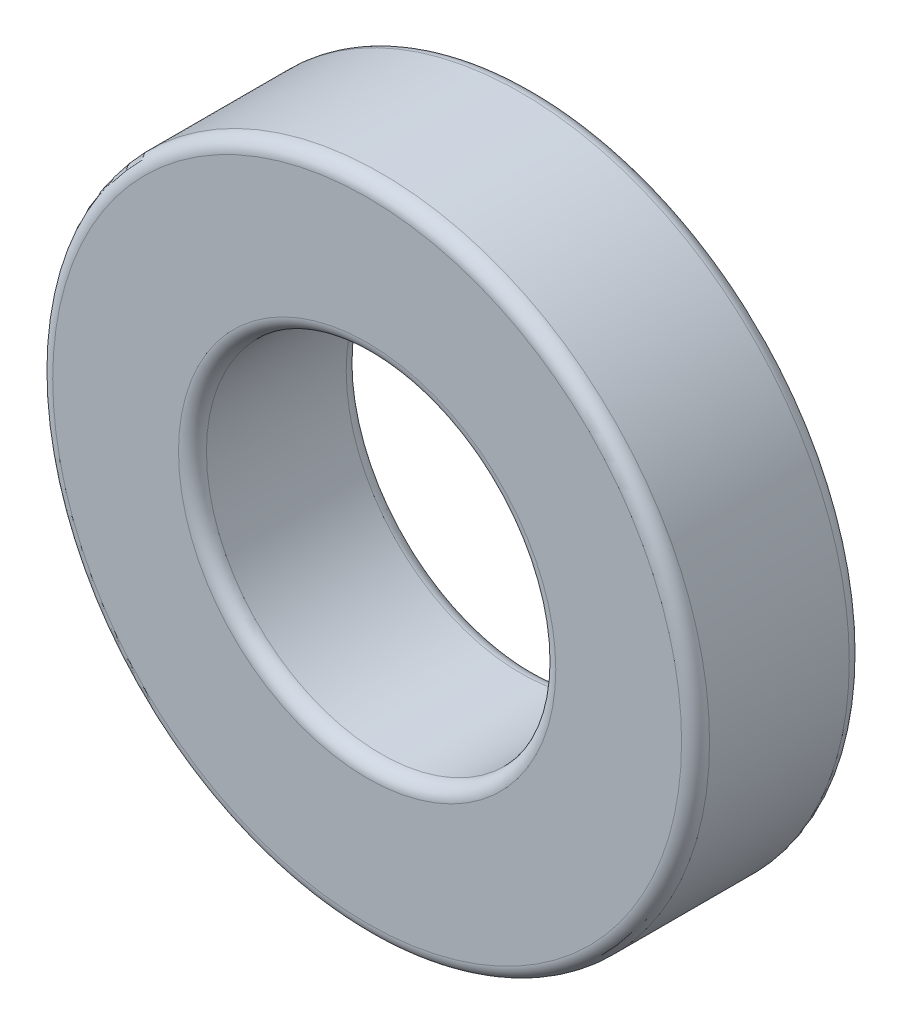
ISO-10303-21;
HEADER;
FILE_DESCRIPTION(('STEP AP214'),'2;1');
FILE_NAME('part.step','',(''),(''),'','','');
FILE_SCHEMA(('AUTOMOTIVE_DESIGN { 1 0 10303 214 1 1 1 1 }'));
ENDSEC;
DATA;
#1=APPLICATION_CONTEXT('core data for automotive mechanical design processes');
#2=APPLICATION_PROTOCOL_DEFINITION('international standard','automotive_design',2000,#1);
#3=PRODUCT_CONTEXT('',#1,'mechanical');
#4=PRODUCT('Part','Part','',(#3));
#5=PRODUCT_RELATED_PRODUCT_CATEGORY('part','',(#4));
#6=PRODUCT_DEFINITION_FORMATION('','',#4);
#7=PRODUCT_DEFINITION_CONTEXT('part definition',#1,'design');
#8=PRODUCT_DEFINITION('design','',#6,#7);
#9=PRODUCT_DEFINITION_SHAPE('','',#8);
#10=(LENGTH_UNIT() NAMED_UNIT(*) SI_UNIT(.MILLI.,.METRE.));
#11=(NAMED_UNIT(*) PLANE_ANGLE_UNIT() SI_UNIT($,.RADIAN.));
#12=(NAMED_UNIT(*) SI_UNIT($,.STERADIAN.) SOLID_ANGLE_UNIT());
#13=UNCERTAINTY_MEASURE_WITH_UNIT(LENGTH_MEASURE(1.E-05),#10,'distance_accuracy_value','');
#14=(GEOMETRIC_REPRESENTATION_CONTEXT(3) GLOBAL_UNCERTAINTY_ASSIGNED_CONTEXT((#13)) GLOBAL_UNIT_ASSIGNED_CONTEXT((#10,
#11,#12)) REPRESENTATION_CONTEXT('',''));
#15=CARTESIAN_POINT('',(0.,0.,0.));
#16=DIRECTION('',(0.,0.,1.));
#17=DIRECTION('',(1.,0.,0.));
#18=AXIS2_PLACEMENT_3D('',#15,#16,#17);
#19=CARTESIAN_POINT('',(0.,0.,12.));
#20=DIRECTION('',(0.,0.,1.));
#21=DIRECTION('',(1.,0.,0.));
#22=AXIS2_PLACEMENT_3D('',#19,#20,#21);
#23=PLANE('',#22);
#24=CARTESIAN_POINT('',(0.,0.,12.));
#25=DIRECTION('',(0.,0.,1.));
#26=DIRECTION('',(1.,0.,0.));
#27=AXIS2_PLACEMENT_3D('',#24,#25,#26);
#28=CIRCLE('',#27,13.5);
#29=CARTESIAN_POINT('',(13.5,0.,12.));
#30=VERTEX_POINT('',#29);
#31=EDGE_CURVE('E43',#30,#30,#28,.F.);
#32=ORIENTED_EDGE('',*,*,#31,.T.);
#33=EDGE_LOOP('',(#32));
#34=FACE_BOUND('',#33,.T.);
#35=CARTESIAN_POINT('',(0.,0.,12.));
#36=DIRECTION('',(0.,0.,1.));
#37=DIRECTION('',(1.,0.,0.));
#38=AXIS2_PLACEMENT_3D('',#35,#36,#37);
#39=CIRCLE('',#38,22.5);
#40=CARTESIAN_POINT('',(22.5,0.,12.));
#41=VERTEX_POINT('',#40);
#42=EDGE_CURVE('E47',#41,#41,#39,.T.);
#43=ORIENTED_EDGE('',*,*,#42,.T.);
#44=EDGE_LOOP('',(#43));
#45=FACE_BOUND('',#44,.T.);
#46=ADVANCED_FACE('F32',(#34,#45),#23,.T.);
#47=CARTESIAN_POINT('',(0.,0.,0.));
#48=DIRECTION('',(0.,0.,1.));
#49=DIRECTION('',(1.,0.,0.));
#50=AXIS2_PLACEMENT_3D('',#47,#48,#49);
#51=PLANE('',#50);
#52=CARTESIAN_POINT('',(0.,0.,0.));
#53=DIRECTION('',(0.,0.,1.));
#54=DIRECTION('',(1.,0.,0.));
#55=AXIS2_PLACEMENT_3D('',#52,#53,#54);
#56=CIRCLE('',#55,13.5);
#57=CARTESIAN_POINT('',(13.5,0.,0.));
#58=VERTEX_POINT('',#57);
#59=EDGE_CURVE('E58',#58,#58,#56,.T.);
#60=ORIENTED_EDGE('',*,*,#59,.T.);
#61=EDGE_LOOP('',(#60));
#62=FACE_BOUND('',#61,.T.);
#63=CARTESIAN_POINT('',(0.,0.,0.));
#64=DIRECTION('',(0.,0.,1.));
#65=DIRECTION('',(1.,0.,0.));
#66=AXIS2_PLACEMENT_3D('',#63,#64,#65);
#67=CIRCLE('',#66,22.5);
#68=CARTESIAN_POINT('',(22.5,0.,0.));
#69=VERTEX_POINT('',#68);
#70=EDGE_CURVE('E61',#69,#69,#67,.F.);
#71=ORIENTED_EDGE('',*,*,#70,.T.);
#72=EDGE_LOOP('',(#71));
#73=FACE_BOUND('',#72,.T.);
#74=ADVANCED_FACE('F65',(#62,#73),#51,.F.);
#75=CARTESIAN_POINT('',(0.,0.,12.));
#76=DIRECTION('',(0.,0.,-1.));
#77=DIRECTION('',(-1.,0.,0.));
#78=AXIS2_PLACEMENT_3D('',#75,#76,#77);
#79=CYLINDRICAL_SURFACE('',#78,23.5);
#80=CARTESIAN_POINT('',(0.,0.,1.));
#81=DIRECTION('',(0.,0.,1.));
#82=DIRECTION('',(1.,0.,0.));
#83=AXIS2_PLACEMENT_3D('',#80,#81,#82);
#84=CIRCLE('',#83,23.5);
#85=CARTESIAN_POINT('',(23.5,0.,1.));
#86=VERTEX_POINT('',#85);
#87=EDGE_CURVE('E10',#86,#86,#84,.T.);
#88=ORIENTED_EDGE('',*,*,#87,.T.);
#89=EDGE_LOOP('',(#88));
#90=FACE_BOUND('',#89,.T.);
#91=CARTESIAN_POINT('',(0.,0.,11.));
#92=DIRECTION('',(0.,0.,1.));
#93=DIRECTION('',(1.,0.,0.));
#94=AXIS2_PLACEMENT_3D('',#91,#92,#93);
#95=CIRCLE('',#94,23.5);
#96=CARTESIAN_POINT('',(23.5,0.,11.));
#97=VERTEX_POINT('',#96);
#98=EDGE_CURVE('E39',#97,#97,#95,.F.);
#99=ORIENTED_EDGE('',*,*,#98,.T.);
#100=EDGE_LOOP('',(#99));
#101=FACE_BOUND('',#100,.T.);
#102=ADVANCED_FACE('F85',(#90,#101),#79,.T.);
#103=CARTESIAN_POINT('',(0.,0.,12.));
#104=DIRECTION('',(0.,0.,-1.));
#105=DIRECTION('',(-1.,0.,0.));
#106=AXIS2_PLACEMENT_3D('',#103,#104,#105);
#107=CYLINDRICAL_SURFACE('',#106,12.5);
#108=CARTESIAN_POINT('',(0.,0.,1.));
#109=DIRECTION('',(0.,0.,1.));
#110=DIRECTION('',(1.,0.,0.));
#111=AXIS2_PLACEMENT_3D('',#108,#109,#110);
#112=CIRCLE('',#111,12.5);
#113=CARTESIAN_POINT('',(12.5,0.,1.));
#114=VERTEX_POINT('',#113);
#115=EDGE_CURVE('E52',#114,#114,#112,.F.);
#116=ORIENTED_EDGE('',*,*,#115,.T.);
#117=EDGE_LOOP('',(#116));
#118=FACE_BOUND('',#117,.T.);
#119=CARTESIAN_POINT('',(0.,0.,11.));
#120=DIRECTION('',(0.,0.,1.));
#121=DIRECTION('',(1.,0.,0.));
#122=AXIS2_PLACEMENT_3D('',#119,#120,#121);
#123=CIRCLE('',#122,12.5);
#124=CARTESIAN_POINT('',(12.5,0.,11.));
#125=VERTEX_POINT('',#124);
#126=EDGE_CURVE('E55',#125,#125,#123,.T.);
#127=ORIENTED_EDGE('',*,*,#126,.T.);
#128=EDGE_LOOP('',(#127));
#129=FACE_BOUND('',#128,.T.);
#130=ADVANCED_FACE('F90',(#118,#129),#107,.F.);
#131=CARTESIAN_POINT('',(0.,0.,1.));
#132=DIRECTION('',(0.,0.,1.));
#133=DIRECTION('',(1.,0.,0.));
#134=AXIS2_PLACEMENT_3D('',#131,#132,#133);
#135=TOROIDAL_SURFACE('',#134,13.5,1.);
#136=ORIENTED_EDGE('',*,*,#115,.F.);
#137=EDGE_LOOP('',(#136));
#138=FACE_BOUND('',#137,.T.);
#139=ORIENTED_EDGE('',*,*,#59,.F.);
#140=EDGE_LOOP('',(#139));
#141=FACE_BOUND('',#140,.T.);
#142=ADVANCED_FACE('F76',(#138,#141),#135,.T.);
#143=CARTESIAN_POINT('',(0.,0.,11.));
#144=DIRECTION('',(0.,0.,1.));
#145=DIRECTION('',(1.,0.,0.));
#146=AXIS2_PLACEMENT_3D('',#143,#144,#145);
#147=TOROIDAL_SURFACE('',#146,13.5,1.);
#148=ORIENTED_EDGE('',*,*,#31,.F.);
#149=EDGE_LOOP('',(#148));
#150=FACE_BOUND('',#149,.T.);
#151=ORIENTED_EDGE('',*,*,#126,.F.);
#152=EDGE_LOOP('',(#151));
#153=FACE_BOUND('',#152,.T.);
#154=ADVANCED_FACE('F70',(#150,#153),#147,.T.);
#155=CARTESIAN_POINT('',(0.,0.,1.));
#156=DIRECTION('',(0.,0.,1.));
#157=DIRECTION('',(1.,0.,0.));
#158=AXIS2_PLACEMENT_3D('',#155,#156,#157);
#159=TOROIDAL_SURFACE('',#158,22.5,1.);
#160=ORIENTED_EDGE('',*,*,#70,.F.);
#161=EDGE_LOOP('',(#160));
#162=FACE_BOUND('',#161,.T.);
#163=ORIENTED_EDGE('',*,*,#87,.F.);
#164=EDGE_LOOP('',(#163));
#165=FACE_BOUND('',#164,.T.);
#166=ADVANCED_FACE('F67',(#162,#165),#159,.T.);
#167=CARTESIAN_POINT('',(0.,0.,11.));
#168=DIRECTION('',(0.,0.,1.));
#169=DIRECTION('',(1.,0.,0.));
#170=AXIS2_PLACEMENT_3D('',#167,#168,#169);
#171=TOROIDAL_SURFACE('',#170,22.5,1.);
#172=ORIENTED_EDGE('',*,*,#98,.F.);
#173=EDGE_LOOP('',(#172));
#174=FACE_BOUND('',#173,.T.);
#175=ORIENTED_EDGE('',*,*,#42,.F.);
#176=EDGE_LOOP('',(#175));
#177=FACE_BOUND('',#176,.T.);
#178=ADVANCED_FACE('F34',(#174,#177),#171,.T.);
#179=CLOSED_SHELL('',(#46,#74,#102,#130,#142,#154,#166,#178));
#180=MANIFOLD_SOLID_BREP('B2',#179);
#181=ADVANCED_BREP_SHAPE_REPRESENTATION('',(#18,#180),#14);
#182=SHAPE_DEFINITION_REPRESENTATION(#9,#181);
ENDSEC;
END-ISO-10303-21;
